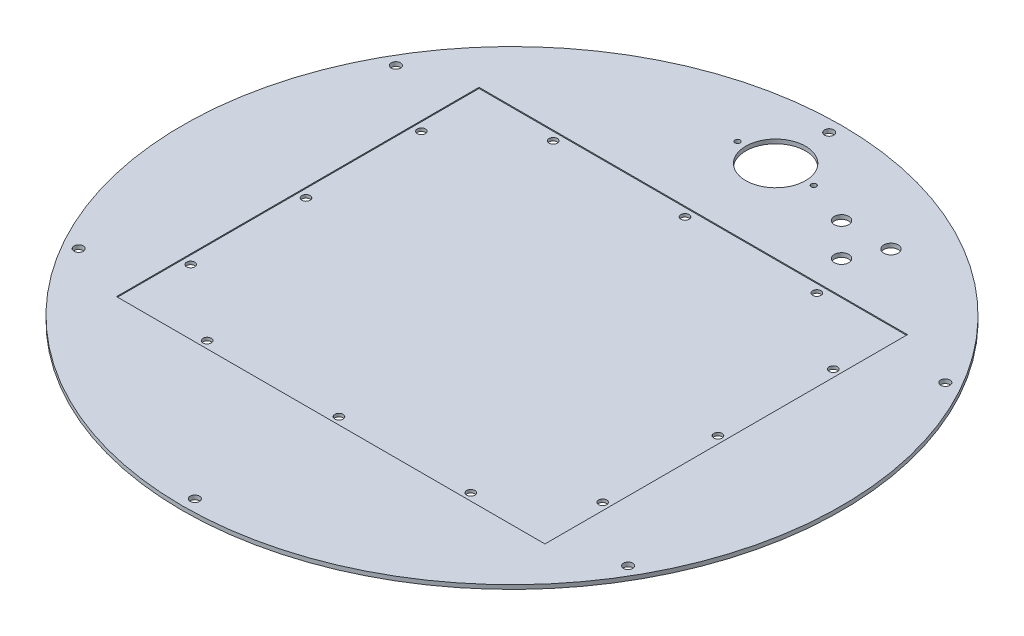
ISO-10303-21;
HEADER;
FILE_DESCRIPTION(('STEP AP214'),'2;1');
FILE_NAME('part.step','',(''),(''),'','','');
FILE_SCHEMA(('AUTOMOTIVE_DESIGN { 1 0 10303 214 1 1 1 1 }'));
ENDSEC;
DATA;
#1=APPLICATION_CONTEXT('core data for automotive mechanical design processes');
#2=APPLICATION_PROTOCOL_DEFINITION('international standard','automotive_design',2000,#1);
#3=PRODUCT_CONTEXT('',#1,'mechanical');
#4=PRODUCT('Part','Part','',(#3));
#5=PRODUCT_RELATED_PRODUCT_CATEGORY('part','',(#4));
#6=PRODUCT_DEFINITION_FORMATION('','',#4);
#7=PRODUCT_DEFINITION_CONTEXT('part definition',#1,'design');
#8=PRODUCT_DEFINITION('design','',#6,#7);
#9=PRODUCT_DEFINITION_SHAPE('','',#8);
#10=(LENGTH_UNIT() NAMED_UNIT(*) SI_UNIT(.MILLI.,.METRE.));
#11=(NAMED_UNIT(*) PLANE_ANGLE_UNIT() SI_UNIT($,.RADIAN.));
#12=(NAMED_UNIT(*) SI_UNIT($,.STERADIAN.) SOLID_ANGLE_UNIT());
#13=UNCERTAINTY_MEASURE_WITH_UNIT(LENGTH_MEASURE(1.E-05),#10,'distance_accuracy_value','');
#14=(GEOMETRIC_REPRESENTATION_CONTEXT(3) GLOBAL_UNCERTAINTY_ASSIGNED_CONTEXT((#13)) GLOBAL_UNIT_ASSIGNED_CONTEXT((#10,
#11,#12)) REPRESENTATION_CONTEXT('',''));
#15=CARTESIAN_POINT('',(0.,0.,0.));
#16=DIRECTION('',(0.,0.,1.));
#17=DIRECTION('',(1.,0.,0.));
#18=AXIS2_PLACEMENT_3D('',#15,#16,#17);
#19=CARTESIAN_POINT('',(0.,-6.35,0.));
#20=DIRECTION('',(0.,1.,0.));
#21=DIRECTION('',(0.,0.,1.));
#22=AXIS2_PLACEMENT_3D('',#19,#20,#21);
#23=CYLINDRICAL_SURFACE('',#22,508.);
#24=CARTESIAN_POINT('',(0.,-6.35,0.));
#25=DIRECTION('',(0.,1.,0.));
#26=DIRECTION('',(0.,0.,1.));
#27=AXIS2_PLACEMENT_3D('',#24,#25,#26);
#28=CIRCLE('',#27,508.);
#29=CARTESIAN_POINT('',(0.,-6.35,508.));
#30=VERTEX_POINT('',#29);
#31=EDGE_CURVE('E11',#30,#30,#28,.T.);
#32=ORIENTED_EDGE('',*,*,#31,.T.);
#33=EDGE_LOOP('',(#32));
#34=FACE_BOUND('',#33,.T.);
#35=CARTESIAN_POINT('',(0.,0.,0.));
#36=DIRECTION('',(0.,1.,0.));
#37=DIRECTION('',(0.,0.,1.));
#38=AXIS2_PLACEMENT_3D('',#35,#36,#37);
#39=CIRCLE('',#38,508.);
#40=CARTESIAN_POINT('',(0.,0.,508.));
#41=VERTEX_POINT('',#40);
#42=EDGE_CURVE('E39',#41,#41,#39,.T.);
#43=ORIENTED_EDGE('',*,*,#42,.F.);
#44=EDGE_LOOP('',(#43));
#45=FACE_BOUND('',#44,.T.);
#46=ADVANCED_FACE('F36',(#34,#45),#23,.T.);
#47=CARTESIAN_POINT('',(0.,-6.35,0.));
#48=DIRECTION('',(0.,1.,0.));
#49=DIRECTION('',(0.,0.,1.));
#50=AXIS2_PLACEMENT_3D('',#47,#48,#49);
#51=PLANE('',#50);
#52=CARTESIAN_POINT('',(177.8,-6.35,-330.2));
#53=DIRECTION('',(0.,1.,0.));
#54=DIRECTION('',(0.,0.,1.));
#55=AXIS2_PLACEMENT_3D('',#52,#53,#54);
#56=CIRCLE('',#55,11.1125);
#57=CARTESIAN_POINT('',(177.8,-6.35,-319.0875));
#58=VERTEX_POINT('',#57);
#59=EDGE_CURVE('E286',#58,#58,#56,.T.);
#60=ORIENTED_EDGE('',*,*,#59,.T.);
#61=EDGE_LOOP('',(#60));
#62=FACE_BOUND('',#61,.T.);
#63=CARTESIAN_POINT('',(203.2,-6.35,-381.));
#64=DIRECTION('',(0.,1.,0.));
#65=DIRECTION('',(0.,0.,1.));
#66=AXIS2_PLACEMENT_3D('',#63,#64,#65);
#67=CIRCLE('',#66,11.1125);
#68=CARTESIAN_POINT('',(203.2,-6.35,-369.8875));
#69=VERTEX_POINT('',#68);
#70=EDGE_CURVE('E294',#69,#69,#67,.T.);
#71=ORIENTED_EDGE('',*,*,#70,.T.);
#72=EDGE_LOOP('',(#71));
#73=FACE_BOUND('',#72,.T.);
#74=CARTESIAN_POINT('',(127.,-6.35,-381.));
#75=DIRECTION('',(0.,1.,0.));
#76=DIRECTION('',(0.,0.,1.));
#77=AXIS2_PLACEMENT_3D('',#74,#75,#76);
#78=CIRCLE('',#77,11.1125);
#79=CARTESIAN_POINT('',(127.,-6.35,-369.8875));
#80=VERTEX_POINT('',#79);
#81=EDGE_CURVE('E300',#80,#80,#78,.T.);
#82=ORIENTED_EDGE('',*,*,#81,.T.);
#83=EDGE_LOOP('',(#82));
#84=FACE_BOUND('',#83,.T.);
#85=CARTESIAN_POINT('',(-58.7374999999999,-6.35,-406.4));
#86=DIRECTION('',(0.,1.,0.));
#87=DIRECTION('',(0.,0.,1.));
#88=AXIS2_PLACEMENT_3D('',#85,#86,#87);
#89=CIRCLE('',#88,3.96875);
#90=CARTESIAN_POINT('',(-58.7374999999999,-6.35,-402.43125));
#91=VERTEX_POINT('',#90);
#92=EDGE_CURVE('E308',#91,#91,#89,.T.);
#93=ORIENTED_EDGE('',*,*,#92,.T.);
#94=EDGE_LOOP('',(#93));
#95=FACE_BOUND('',#94,.T.);
#96=CARTESIAN_POINT('',(58.7375,-6.35,-406.4));
#97=DIRECTION('',(0.,1.,0.));
#98=DIRECTION('',(0.,0.,1.));
#99=AXIS2_PLACEMENT_3D('',#96,#97,#98);
#100=CIRCLE('',#99,3.96874999999999);
#101=CARTESIAN_POINT('',(58.7375,-6.35,-402.43125));
#102=VERTEX_POINT('',#101);
#103=EDGE_CURVE('E314',#102,#102,#100,.T.);
#104=ORIENTED_EDGE('',*,*,#103,.T.);
#105=EDGE_LOOP('',(#104));
#106=FACE_BOUND('',#105,.T.);
#107=CARTESIAN_POINT('',(0.,-6.35,-406.4));
#108=DIRECTION('',(0.,1.,0.));
#109=DIRECTION('',(0.,0.,1.));
#110=AXIS2_PLACEMENT_3D('',#107,#108,#109);
#111=CIRCLE('',#110,46.0375000000001);
#112=CARTESIAN_POINT('',(0.,-6.35,-360.3625));
#113=VERTEX_POINT('',#112);
#114=EDGE_CURVE('E318',#113,#113,#111,.T.);
#115=ORIENTED_EDGE('',*,*,#114,.T.);
#116=EDGE_LOOP('',(#115));
#117=FACE_BOUND('',#116,.T.);
#118=CARTESIAN_POINT('',(-317.5,-6.35,-177.8));
#119=DIRECTION('',(0.,1.,0.));
#120=DIRECTION('',(0.,0.,1.));
#121=AXIS2_PLACEMENT_3D('',#118,#119,#120);
#122=CIRCLE('',#121,6.35000000000002);
#123=CARTESIAN_POINT('',(-317.5,-6.35,-171.45));
#124=VERTEX_POINT('',#123);
#125=EDGE_CURVE('E326',#124,#124,#122,.T.);
#126=ORIENTED_EDGE('',*,*,#125,.T.);
#127=EDGE_LOOP('',(#126));
#128=FACE_BOUND('',#127,.T.);
#129=CARTESIAN_POINT('',(-317.5,-6.35,0.));
#130=DIRECTION('',(0.,1.,0.));
#131=DIRECTION('',(0.,0.,1.));
#132=AXIS2_PLACEMENT_3D('',#129,#130,#131);
#133=CIRCLE('',#132,6.35000000000002);
#134=CARTESIAN_POINT('',(-317.5,-6.35,6.35000000000002));
#135=VERTEX_POINT('',#134);
#136=EDGE_CURVE('E332',#135,#135,#133,.T.);
#137=ORIENTED_EDGE('',*,*,#136,.T.);
#138=EDGE_LOOP('',(#137));
#139=FACE_BOUND('',#138,.T.);
#140=CARTESIAN_POINT('',(-317.5,-6.35,177.8));
#141=DIRECTION('',(0.,1.,0.));
#142=DIRECTION('',(0.,0.,1.));
#143=AXIS2_PLACEMENT_3D('',#140,#141,#142);
#144=CIRCLE('',#143,6.35000000000002);
#145=CARTESIAN_POINT('',(-317.5,-6.35,184.15));
#146=VERTEX_POINT('',#145);
#147=EDGE_CURVE('E338',#146,#146,#144,.T.);
#148=ORIENTED_EDGE('',*,*,#147,.T.);
#149=EDGE_LOOP('',(#148));
#150=FACE_BOUND('',#149,.T.);
#151=CARTESIAN_POINT('',(317.5,-6.35,177.8));
#152=DIRECTION('',(0.,1.,0.));
#153=DIRECTION('',(0.,0.,1.));
#154=AXIS2_PLACEMENT_3D('',#151,#152,#153);
#155=CIRCLE('',#154,6.35000000000002);
#156=CARTESIAN_POINT('',(317.5,-6.35,184.15));
#157=VERTEX_POINT('',#156);
#158=EDGE_CURVE('E344',#157,#157,#155,.T.);
#159=ORIENTED_EDGE('',*,*,#158,.T.);
#160=EDGE_LOOP('',(#159));
#161=FACE_BOUND('',#160,.T.);
#162=CARTESIAN_POINT('',(317.5,-6.35,0.));
#163=DIRECTION('',(0.,1.,0.));
#164=DIRECTION('',(0.,0.,1.));
#165=AXIS2_PLACEMENT_3D('',#162,#163,#164);
#166=CIRCLE('',#165,6.35000000000002);
#167=CARTESIAN_POINT('',(317.5,-6.35,6.34999999999995));
#168=VERTEX_POINT('',#167);
#169=EDGE_CURVE('E350',#168,#168,#166,.T.);
#170=ORIENTED_EDGE('',*,*,#169,.T.);
#171=EDGE_LOOP('',(#170));
#172=FACE_BOUND('',#171,.T.);
#173=CARTESIAN_POINT('',(317.5,-6.35,-177.8));
#174=DIRECTION('',(0.,1.,0.));
#175=DIRECTION('',(0.,0.,1.));
#176=AXIS2_PLACEMENT_3D('',#173,#174,#175);
#177=CIRCLE('',#176,6.35000000000002);
#178=CARTESIAN_POINT('',(317.5,-6.35,-171.45));
#179=VERTEX_POINT('',#178);
#180=EDGE_CURVE('E356',#179,#179,#177,.T.);
#181=ORIENTED_EDGE('',*,*,#180,.T.);
#182=EDGE_LOOP('',(#181));
#183=FACE_BOUND('',#182,.T.);
#184=CARTESIAN_POINT('',(-203.2,-6.35,-266.7));
#185=DIRECTION('',(0.,1.,0.));
#186=DIRECTION('',(0.,0.,1.));
#187=AXIS2_PLACEMENT_3D('',#184,#185,#186);
#188=CIRCLE('',#187,6.34999999999999);
#189=CARTESIAN_POINT('',(-203.2,-6.35,-260.35));
#190=VERTEX_POINT('',#189);
#191=EDGE_CURVE('E362',#190,#190,#188,.T.);
#192=ORIENTED_EDGE('',*,*,#191,.T.);
#193=EDGE_LOOP('',(#192));
#194=FACE_BOUND('',#193,.T.);
#195=CARTESIAN_POINT('',(0.,-6.35,-266.7));
#196=DIRECTION('',(0.,1.,0.));
#197=DIRECTION('',(0.,0.,1.));
#198=AXIS2_PLACEMENT_3D('',#195,#196,#197);
#199=CIRCLE('',#198,6.35);
#200=CARTESIAN_POINT('',(0.,-6.35,-260.35));
#201=VERTEX_POINT('',#200);
#202=EDGE_CURVE('E368',#201,#201,#199,.T.);
#203=ORIENTED_EDGE('',*,*,#202,.T.);
#204=EDGE_LOOP('',(#203));
#205=FACE_BOUND('',#204,.T.);
#206=CARTESIAN_POINT('',(203.2,-6.35,-266.7));
#207=DIRECTION('',(0.,1.,0.));
#208=DIRECTION('',(0.,0.,1.));
#209=AXIS2_PLACEMENT_3D('',#206,#207,#208);
#210=CIRCLE('',#209,6.34999999999999);
#211=CARTESIAN_POINT('',(203.2,-6.35,-260.35));
#212=VERTEX_POINT('',#211);
#213=EDGE_CURVE('E374',#212,#212,#210,.T.);
#214=ORIENTED_EDGE('',*,*,#213,.T.);
#215=EDGE_LOOP('',(#214));
#216=FACE_BOUND('',#215,.T.);
#217=CARTESIAN_POINT('',(203.2,-6.35,266.7));
#218=DIRECTION('',(0.,1.,0.));
#219=DIRECTION('',(0.,0.,1.));
#220=AXIS2_PLACEMENT_3D('',#217,#218,#219);
#221=CIRCLE('',#220,6.34999999999999);
#222=CARTESIAN_POINT('',(203.2,-6.35,273.05));
#223=VERTEX_POINT('',#222);
#224=EDGE_CURVE('E380',#223,#223,#221,.T.);
#225=ORIENTED_EDGE('',*,*,#224,.T.);
#226=EDGE_LOOP('',(#225));
#227=FACE_BOUND('',#226,.T.);
#228=CARTESIAN_POINT('',(0.,-6.35,266.7));
#229=DIRECTION('',(0.,1.,0.));
#230=DIRECTION('',(0.,0.,1.));
#231=AXIS2_PLACEMENT_3D('',#228,#229,#230);
#232=CIRCLE('',#231,6.35);
#233=CARTESIAN_POINT('',(0.,-6.35,273.05));
#234=VERTEX_POINT('',#233);
#235=EDGE_CURVE('E386',#234,#234,#232,.T.);
#236=ORIENTED_EDGE('',*,*,#235,.T.);
#237=EDGE_LOOP('',(#236));
#238=FACE_BOUND('',#237,.T.);
#239=CARTESIAN_POINT('',(-203.2,-6.35,266.7));
#240=DIRECTION('',(0.,1.,0.));
#241=DIRECTION('',(0.,0.,1.));
#242=AXIS2_PLACEMENT_3D('',#239,#240,#241);
#243=CIRCLE('',#242,6.34999999999999);
#244=CARTESIAN_POINT('',(-203.2,-6.35,273.05));
#245=VERTEX_POINT('',#244);
#246=EDGE_CURVE('E107',#245,#245,#243,.T.);
#247=ORIENTED_EDGE('',*,*,#246,.T.);
#248=EDGE_LOOP('',(#247));
#249=FACE_BOUND('',#248,.T.);
#250=CARTESIAN_POINT('',(0.,-6.35,-488.95));
#251=DIRECTION('',(0.,1.,0.));
#252=DIRECTION('',(0.,0.,1.));
#253=AXIS2_PLACEMENT_3D('',#250,#251,#252);
#254=CIRCLE('',#253,7.14375);
#255=CARTESIAN_POINT('',(0.,-6.35,-481.80625));
#256=VERTEX_POINT('',#255);
#257=EDGE_CURVE('E118',#256,#256,#254,.T.);
#258=ORIENTED_EDGE('',*,*,#257,.T.);
#259=EDGE_LOOP('',(#258));
#260=FACE_BOUND('',#259,.T.);
#261=CARTESIAN_POINT('',(423.443121180401,-6.35,-244.475));
#262=DIRECTION('',(0.,1.,0.));
#263=DIRECTION('',(0.,0.,1.));
#264=AXIS2_PLACEMENT_3D('',#261,#262,#263);
#265=CIRCLE('',#264,7.14375);
#266=CARTESIAN_POINT('',(423.443121180401,-6.35,-237.33125));
#267=VERTEX_POINT('',#266);
#268=EDGE_CURVE('E124',#267,#267,#265,.T.);
#269=ORIENTED_EDGE('',*,*,#268,.T.);
#270=EDGE_LOOP('',(#269));
#271=FACE_BOUND('',#270,.T.);
#272=CARTESIAN_POINT('',(423.443121180401,-6.35,244.475));
#273=DIRECTION('',(0.,1.,0.));
#274=DIRECTION('',(0.,0.,1.));
#275=AXIS2_PLACEMENT_3D('',#272,#273,#274);
#276=CIRCLE('',#275,7.14375);
#277=CARTESIAN_POINT('',(423.443121180401,-6.35,251.61875));
#278=VERTEX_POINT('',#277);
#279=EDGE_CURVE('E130',#278,#278,#276,.T.);
#280=ORIENTED_EDGE('',*,*,#279,.T.);
#281=EDGE_LOOP('',(#280));
#282=FACE_BOUND('',#281,.T.);
#283=CARTESIAN_POINT('',(0.,-6.35,488.95));
#284=DIRECTION('',(0.,1.,0.));
#285=DIRECTION('',(0.,0.,1.));
#286=AXIS2_PLACEMENT_3D('',#283,#284,#285);
#287=CIRCLE('',#286,7.14375);
#288=CARTESIAN_POINT('',(0.,-6.35,496.09375));
#289=VERTEX_POINT('',#288);
#290=EDGE_CURVE('E136',#289,#289,#287,.T.);
#291=ORIENTED_EDGE('',*,*,#290,.T.);
#292=EDGE_LOOP('',(#291));
#293=FACE_BOUND('',#292,.T.);
#294=CARTESIAN_POINT('',(-423.443121180401,-6.35,244.475));
#295=DIRECTION('',(0.,1.,0.));
#296=DIRECTION('',(0.,0.,1.));
#297=AXIS2_PLACEMENT_3D('',#294,#295,#296);
#298=CIRCLE('',#297,7.14375);
#299=CARTESIAN_POINT('',(-423.443121180401,-6.35,251.61875));
#300=VERTEX_POINT('',#299);
#301=EDGE_CURVE('E142',#300,#300,#298,.T.);
#302=ORIENTED_EDGE('',*,*,#301,.T.);
#303=EDGE_LOOP('',(#302));
#304=FACE_BOUND('',#303,.T.);
#305=CARTESIAN_POINT('',(-423.443121180401,-6.35,-244.475));
#306=DIRECTION('',(0.,1.,0.));
#307=DIRECTION('',(0.,0.,1.));
#308=AXIS2_PLACEMENT_3D('',#305,#306,#307);
#309=CIRCLE('',#308,7.14375);
#310=CARTESIAN_POINT('',(-423.443121180401,-6.35,-237.33125));
#311=VERTEX_POINT('',#310);
#312=EDGE_CURVE('E148',#311,#311,#309,.T.);
#313=ORIENTED_EDGE('',*,*,#312,.T.);
#314=EDGE_LOOP('',(#313));
#315=FACE_BOUND('',#314,.T.);
#316=ORIENTED_EDGE('',*,*,#31,.F.);
#317=EDGE_LOOP('',(#316));
#318=FACE_BOUND('',#317,.T.);
#319=ADVANCED_FACE('F158',(#62,#73,#84,#95,#106,#117,#128,#139,#150,#161,#172,#183,#194,#205,
#216,#227,#238,#249,#260,#271,#282,#293,#304,#315,#318),#51,.F.);
#320=CARTESIAN_POINT('',(0.,0.,0.));
#321=DIRECTION('',(0.,1.,0.));
#322=DIRECTION('',(0.,0.,1.));
#323=AXIS2_PLACEMENT_3D('',#320,#321,#322);
#324=PLANE('',#323);
#325=CARTESIAN_POINT('',(177.8,0.,-330.2));
#326=DIRECTION('',(0.,1.,0.));
#327=DIRECTION('',(0.,0.,1.));
#328=AXIS2_PLACEMENT_3D('',#325,#326,#327);
#329=CIRCLE('',#328,11.1125);
#330=CARTESIAN_POINT('',(177.8,0.,-319.0875));
#331=VERTEX_POINT('',#330);
#332=EDGE_CURVE('E289',#331,#331,#329,.T.);
#333=ORIENTED_EDGE('',*,*,#332,.F.);
#334=EDGE_LOOP('',(#333));
#335=FACE_BOUND('',#334,.T.);
#336=CARTESIAN_POINT('',(203.2,0.,-381.));
#337=DIRECTION('',(0.,1.,0.));
#338=DIRECTION('',(0.,0.,1.));
#339=AXIS2_PLACEMENT_3D('',#336,#337,#338);
#340=CIRCLE('',#339,11.1125);
#341=CARTESIAN_POINT('',(203.2,0.,-369.8875));
#342=VERTEX_POINT('',#341);
#343=EDGE_CURVE('E291',#342,#342,#340,.T.);
#344=ORIENTED_EDGE('',*,*,#343,.F.);
#345=EDGE_LOOP('',(#344));
#346=FACE_BOUND('',#345,.T.);
#347=CARTESIAN_POINT('',(127.,0.,-381.));
#348=DIRECTION('',(0.,1.,0.));
#349=DIRECTION('',(0.,0.,1.));
#350=AXIS2_PLACEMENT_3D('',#347,#348,#349);
#351=CIRCLE('',#350,11.1125);
#352=CARTESIAN_POINT('',(127.,0.,-369.8875));
#353=VERTEX_POINT('',#352);
#354=EDGE_CURVE('E297',#353,#353,#351,.T.);
#355=ORIENTED_EDGE('',*,*,#354,.F.);
#356=EDGE_LOOP('',(#355));
#357=FACE_BOUND('',#356,.T.);
#358=CARTESIAN_POINT('',(-58.7374999999999,0.,-406.4));
#359=DIRECTION('',(0.,1.,0.));
#360=DIRECTION('',(0.,0.,1.));
#361=AXIS2_PLACEMENT_3D('',#358,#359,#360);
#362=CIRCLE('',#361,3.96875);
#363=CARTESIAN_POINT('',(-58.7374999999999,0.,-402.43125));
#364=VERTEX_POINT('',#363);
#365=EDGE_CURVE('E303',#364,#364,#362,.T.);
#366=ORIENTED_EDGE('',*,*,#365,.F.);
#367=EDGE_LOOP('',(#366));
#368=FACE_BOUND('',#367,.T.);
#369=CARTESIAN_POINT('',(58.7375,0.,-406.4));
#370=DIRECTION('',(0.,1.,0.));
#371=DIRECTION('',(0.,0.,1.));
#372=AXIS2_PLACEMENT_3D('',#369,#370,#371);
#373=CIRCLE('',#372,3.96874999999999);
#374=CARTESIAN_POINT('',(58.7375,0.,-402.43125));
#375=VERTEX_POINT('',#374);
#376=EDGE_CURVE('E311',#375,#375,#373,.T.);
#377=ORIENTED_EDGE('',*,*,#376,.F.);
#378=EDGE_LOOP('',(#377));
#379=FACE_BOUND('',#378,.T.);
#380=CARTESIAN_POINT('',(0.,0.,-406.4));
#381=DIRECTION('',(0.,1.,0.));
#382=DIRECTION('',(0.,0.,1.));
#383=AXIS2_PLACEMENT_3D('',#380,#381,#382);
#384=CIRCLE('',#383,46.0375000000001);
#385=CARTESIAN_POINT('',(0.,0.,-360.3625));
#386=VERTEX_POINT('',#385);
#387=EDGE_CURVE('E317',#386,#386,#384,.T.);
#388=ORIENTED_EDGE('',*,*,#387,.F.);
#389=EDGE_LOOP('',(#388));
#390=FACE_BOUND('',#389,.T.);
#391=DIRECTION('',(0.,0.,1.));
#392=VECTOR('',#391,1.);
#393=CARTESIAN_POINT('',(-330.2,0.,-279.4));
#394=LINE('',#393,#392);
#395=CARTESIAN_POINT('',(-330.2,0.,-279.4));
#396=VERTEX_POINT('',#395);
#397=CARTESIAN_POINT('',(-330.2,0.,279.4));
#398=VERTEX_POINT('',#397);
#399=EDGE_CURVE('E50',#396,#398,#394,.T.);
#400=ORIENTED_EDGE('',*,*,#399,.F.);
#401=DIRECTION('',(-1.,0.,0.));
#402=VECTOR('',#401,1.);
#403=CARTESIAN_POINT('',(-330.2,0.,-279.4));
#404=LINE('',#403,#402);
#405=CARTESIAN_POINT('',(330.2,0.,-279.4));
#406=VERTEX_POINT('',#405);
#407=EDGE_CURVE('E101',#406,#396,#404,.T.);
#408=ORIENTED_EDGE('',*,*,#407,.F.);
#409=DIRECTION('',(0.,0.,-1.));
#410=VECTOR('',#409,1.);
#411=CARTESIAN_POINT('',(330.2,0.,-279.4));
#412=LINE('',#411,#410);
#413=CARTESIAN_POINT('',(330.2,0.,279.4));
#414=VERTEX_POINT('',#413);
#415=EDGE_CURVE('E109',#414,#406,#412,.T.);
#416=ORIENTED_EDGE('',*,*,#415,.F.);
#417=DIRECTION('',(1.,0.,0.));
#418=VECTOR('',#417,1.);
#419=CARTESIAN_POINT('',(-330.2,0.,279.4));
#420=LINE('',#419,#418);
#421=EDGE_CURVE('E85',#398,#414,#420,.T.);
#422=ORIENTED_EDGE('',*,*,#421,.F.);
#423=EDGE_LOOP('',(#400,#408,#416,#422));
#424=FACE_BOUND('',#423,.T.);
#425=CARTESIAN_POINT('',(0.,0.,-488.95));
#426=DIRECTION('',(0.,1.,0.));
#427=DIRECTION('',(0.,0.,1.));
#428=AXIS2_PLACEMENT_3D('',#425,#426,#427);
#429=CIRCLE('',#428,7.14374999999999);
#430=CARTESIAN_POINT('',(0.,0.,-481.80625));
#431=VERTEX_POINT('',#430);
#432=EDGE_CURVE('E113',#431,#431,#429,.T.);
#433=ORIENTED_EDGE('',*,*,#432,.F.);
#434=EDGE_LOOP('',(#433));
#435=FACE_BOUND('',#434,.T.);
#436=CARTESIAN_POINT('',(423.443121180401,0.,-244.475));
#437=DIRECTION('',(0.,1.,0.));
#438=DIRECTION('',(0.,0.,1.));
#439=AXIS2_PLACEMENT_3D('',#436,#437,#438);
#440=CIRCLE('',#439,7.14375);
#441=CARTESIAN_POINT('',(423.443121180401,0.,-237.33125));
#442=VERTEX_POINT('',#441);
#443=EDGE_CURVE('E121',#442,#442,#440,.T.);
#444=ORIENTED_EDGE('',*,*,#443,.F.);
#445=EDGE_LOOP('',(#444));
#446=FACE_BOUND('',#445,.T.);
#447=CARTESIAN_POINT('',(423.443121180401,0.,244.475));
#448=DIRECTION('',(0.,1.,0.));
#449=DIRECTION('',(0.,0.,1.));
#450=AXIS2_PLACEMENT_3D('',#447,#448,#449);
#451=CIRCLE('',#450,7.14375);
#452=CARTESIAN_POINT('',(423.443121180401,0.,251.61875));
#453=VERTEX_POINT('',#452);
#454=EDGE_CURVE('E127',#453,#453,#451,.T.);
#455=ORIENTED_EDGE('',*,*,#454,.F.);
#456=EDGE_LOOP('',(#455));
#457=FACE_BOUND('',#456,.T.);
#458=CARTESIAN_POINT('',(0.,0.,488.95));
#459=DIRECTION('',(0.,1.,0.));
#460=DIRECTION('',(0.,0.,1.));
#461=AXIS2_PLACEMENT_3D('',#458,#459,#460);
#462=CIRCLE('',#461,7.14374999999999);
#463=CARTESIAN_POINT('',(0.,0.,496.09375));
#464=VERTEX_POINT('',#463);
#465=EDGE_CURVE('E133',#464,#464,#462,.T.);
#466=ORIENTED_EDGE('',*,*,#465,.F.);
#467=EDGE_LOOP('',(#466));
#468=FACE_BOUND('',#467,.T.);
#469=CARTESIAN_POINT('',(-423.443121180401,0.,244.475));
#470=DIRECTION('',(0.,1.,0.));
#471=DIRECTION('',(0.,0.,1.));
#472=AXIS2_PLACEMENT_3D('',#469,#470,#471);
#473=CIRCLE('',#472,7.14375);
#474=CARTESIAN_POINT('',(-423.443121180401,0.,251.61875));
#475=VERTEX_POINT('',#474);
#476=EDGE_CURVE('E139',#475,#475,#473,.T.);
#477=ORIENTED_EDGE('',*,*,#476,.F.);
#478=EDGE_LOOP('',(#477));
#479=FACE_BOUND('',#478,.T.);
#480=CARTESIAN_POINT('',(-423.443121180401,0.,-244.475));
#481=DIRECTION('',(0.,1.,0.));
#482=DIRECTION('',(0.,0.,1.));
#483=AXIS2_PLACEMENT_3D('',#480,#481,#482);
#484=CIRCLE('',#483,7.14375);
#485=CARTESIAN_POINT('',(-423.443121180401,0.,-237.33125));
#486=VERTEX_POINT('',#485);
#487=EDGE_CURVE('E145',#486,#486,#484,.T.);
#488=ORIENTED_EDGE('',*,*,#487,.F.);
#489=EDGE_LOOP('',(#488));
#490=FACE_BOUND('',#489,.T.);
#491=ORIENTED_EDGE('',*,*,#42,.T.);
#492=EDGE_LOOP('',(#491));
#493=FACE_BOUND('',#492,.T.);
#494=ADVANCED_FACE('F155',(#335,#346,#357,#368,#379,#390,#424,#435,#446,#457,#468,#479,#490,
#493),#324,.T.);
#495=CARTESIAN_POINT('',(-423.443121180401,0.,-244.475));
#496=DIRECTION('',(0.,1.,0.));
#497=DIRECTION('',(0.,0.,1.));
#498=AXIS2_PLACEMENT_3D('',#495,#496,#497);
#499=CYLINDRICAL_SURFACE('',#498,7.14375);
#500=ORIENTED_EDGE('',*,*,#312,.F.);
#501=EDGE_LOOP('',(#500));
#502=FACE_BOUND('',#501,.T.);
#503=ORIENTED_EDGE('',*,*,#487,.T.);
#504=EDGE_LOOP('',(#503));
#505=FACE_BOUND('',#504,.T.);
#506=ADVANCED_FACE('F170',(#502,#505),#499,.F.);
#507=CARTESIAN_POINT('',(-423.443121180401,0.,244.475));
#508=DIRECTION('',(0.,1.,0.));
#509=DIRECTION('',(0.,0.,1.));
#510=AXIS2_PLACEMENT_3D('',#507,#508,#509);
#511=CYLINDRICAL_SURFACE('',#510,7.14375);
#512=ORIENTED_EDGE('',*,*,#301,.F.);
#513=EDGE_LOOP('',(#512));
#514=FACE_BOUND('',#513,.T.);
#515=ORIENTED_EDGE('',*,*,#476,.T.);
#516=EDGE_LOOP('',(#515));
#517=FACE_BOUND('',#516,.T.);
#518=ADVANCED_FACE('F177',(#514,#517),#511,.F.);
#519=CARTESIAN_POINT('',(0.,0.,488.95));
#520=DIRECTION('',(0.,1.,0.));
#521=DIRECTION('',(0.,0.,1.));
#522=AXIS2_PLACEMENT_3D('',#519,#520,#521);
#523=CYLINDRICAL_SURFACE('',#522,7.14374999999999);
#524=ORIENTED_EDGE('',*,*,#290,.F.);
#525=EDGE_LOOP('',(#524));
#526=FACE_BOUND('',#525,.T.);
#527=ORIENTED_EDGE('',*,*,#465,.T.);
#528=EDGE_LOOP('',(#527));
#529=FACE_BOUND('',#528,.T.);
#530=ADVANCED_FACE('F181',(#526,#529),#523,.F.);
#531=CARTESIAN_POINT('',(423.443121180401,0.,244.475));
#532=DIRECTION('',(0.,1.,0.));
#533=DIRECTION('',(0.,0.,1.));
#534=AXIS2_PLACEMENT_3D('',#531,#532,#533);
#535=CYLINDRICAL_SURFACE('',#534,7.14375);
#536=ORIENTED_EDGE('',*,*,#279,.F.);
#537=EDGE_LOOP('',(#536));
#538=FACE_BOUND('',#537,.T.);
#539=ORIENTED_EDGE('',*,*,#454,.T.);
#540=EDGE_LOOP('',(#539));
#541=FACE_BOUND('',#540,.T.);
#542=ADVANCED_FACE('F185',(#538,#541),#535,.F.);
#543=CARTESIAN_POINT('',(423.443121180401,0.,-244.475));
#544=DIRECTION('',(0.,1.,0.));
#545=DIRECTION('',(0.,0.,1.));
#546=AXIS2_PLACEMENT_3D('',#543,#544,#545);
#547=CYLINDRICAL_SURFACE('',#546,7.14375);
#548=ORIENTED_EDGE('',*,*,#268,.F.);
#549=EDGE_LOOP('',(#548));
#550=FACE_BOUND('',#549,.T.);
#551=ORIENTED_EDGE('',*,*,#443,.T.);
#552=EDGE_LOOP('',(#551));
#553=FACE_BOUND('',#552,.T.);
#554=ADVANCED_FACE('F189',(#550,#553),#547,.F.);
#555=CARTESIAN_POINT('',(0.,0.,-488.95));
#556=DIRECTION('',(0.,1.,0.));
#557=DIRECTION('',(0.,0.,1.));
#558=AXIS2_PLACEMENT_3D('',#555,#556,#557);
#559=CYLINDRICAL_SURFACE('',#558,7.14374999999999);
#560=ORIENTED_EDGE('',*,*,#257,.F.);
#561=EDGE_LOOP('',(#560));
#562=FACE_BOUND('',#561,.T.);
#563=ORIENTED_EDGE('',*,*,#432,.T.);
#564=EDGE_LOOP('',(#563));
#565=FACE_BOUND('',#564,.T.);
#566=ADVANCED_FACE('F193',(#562,#565),#559,.F.);
#567=CARTESIAN_POINT('',(-330.2,-1.5875,-279.4));
#568=DIRECTION('',(-1.,0.,0.));
#569=DIRECTION('',(0.,0.,1.));
#570=AXIS2_PLACEMENT_3D('',#567,#568,#569);
#571=PLANE('',#570);
#572=ORIENTED_EDGE('',*,*,#399,.T.);
#573=DIRECTION('',(0.,1.,0.));
#574=VECTOR('',#573,1.);
#575=CARTESIAN_POINT('',(-330.2,-1.5875,279.4));
#576=LINE('',#575,#574);
#577=CARTESIAN_POINT('',(-330.2,-1.5875,279.4));
#578=VERTEX_POINT('',#577);
#579=EDGE_CURVE('E73',#578,#398,#576,.T.);
#580=ORIENTED_EDGE('',*,*,#579,.F.);
#581=DIRECTION('',(0.,0.,1.));
#582=VECTOR('',#581,1.);
#583=CARTESIAN_POINT('',(-330.2,-1.5875,-279.4));
#584=LINE('',#583,#582);
#585=CARTESIAN_POINT('',(-330.2,-1.5875,-279.4));
#586=VERTEX_POINT('',#585);
#587=EDGE_CURVE('E99',#586,#578,#584,.T.);
#588=ORIENTED_EDGE('',*,*,#587,.F.);
#589=DIRECTION('',(0.,1.,0.));
#590=VECTOR('',#589,1.);
#591=CARTESIAN_POINT('',(-330.2,-1.5875,-279.4));
#592=LINE('',#591,#590);
#593=EDGE_CURVE('E58',#586,#396,#592,.T.);
#594=ORIENTED_EDGE('',*,*,#593,.T.);
#595=EDGE_LOOP('',(#572,#580,#588,#594));
#596=FACE_BOUND('',#595,.T.);
#597=ADVANCED_FACE('F197',(#596),#571,.F.);
#598=CARTESIAN_POINT('',(-330.2,-1.5875,-279.4));
#599=DIRECTION('',(0.,0.,-1.));
#600=DIRECTION('',(-1.,0.,0.));
#601=AXIS2_PLACEMENT_3D('',#598,#599,#600);
#602=PLANE('',#601);
#603=ORIENTED_EDGE('',*,*,#407,.T.);
#604=ORIENTED_EDGE('',*,*,#593,.F.);
#605=DIRECTION('',(-1.,0.,0.));
#606=VECTOR('',#605,1.);
#607=CARTESIAN_POINT('',(-330.2,-1.5875,-279.4));
#608=LINE('',#607,#606);
#609=CARTESIAN_POINT('',(330.2,-1.5875,-279.4));
#610=VERTEX_POINT('',#609);
#611=EDGE_CURVE('E96',#610,#586,#608,.T.);
#612=ORIENTED_EDGE('',*,*,#611,.F.);
#613=DIRECTION('',(0.,1.,0.));
#614=VECTOR('',#613,1.);
#615=CARTESIAN_POINT('',(330.2,-1.5875,-279.4));
#616=LINE('',#615,#614);
#617=EDGE_CURVE('E89',#610,#406,#616,.T.);
#618=ORIENTED_EDGE('',*,*,#617,.T.);
#619=EDGE_LOOP('',(#603,#604,#612,#618));
#620=FACE_BOUND('',#619,.T.);
#621=ADVANCED_FACE('F201',(#620),#602,.F.);
#622=CARTESIAN_POINT('',(330.2,-1.5875,-279.4));
#623=DIRECTION('',(1.,0.,0.));
#624=DIRECTION('',(0.,0.,-1.));
#625=AXIS2_PLACEMENT_3D('',#622,#623,#624);
#626=PLANE('',#625);
#627=ORIENTED_EDGE('',*,*,#415,.T.);
#628=ORIENTED_EDGE('',*,*,#617,.F.);
#629=DIRECTION('',(0.,0.,-1.));
#630=VECTOR('',#629,1.);
#631=CARTESIAN_POINT('',(330.2,-1.5875,-279.4));
#632=LINE('',#631,#630);
#633=CARTESIAN_POINT('',(330.2,-1.5875,279.4));
#634=VERTEX_POINT('',#633);
#635=EDGE_CURVE('E92',#634,#610,#632,.T.);
#636=ORIENTED_EDGE('',*,*,#635,.F.);
#637=DIRECTION('',(0.,1.,0.));
#638=VECTOR('',#637,1.);
#639=CARTESIAN_POINT('',(330.2,-1.5875,279.4));
#640=LINE('',#639,#638);
#641=EDGE_CURVE('E78',#634,#414,#640,.T.);
#642=ORIENTED_EDGE('',*,*,#641,.T.);
#643=EDGE_LOOP('',(#627,#628,#636,#642));
#644=FACE_BOUND('',#643,.T.);
#645=ADVANCED_FACE('F93',(#644),#626,.F.);
#646=CARTESIAN_POINT('',(-330.2,-1.5875,279.4));
#647=DIRECTION('',(0.,0.,1.));
#648=DIRECTION('',(1.,0.,0.));
#649=AXIS2_PLACEMENT_3D('',#646,#647,#648);
#650=PLANE('',#649);
#651=ORIENTED_EDGE('',*,*,#421,.T.);
#652=ORIENTED_EDGE('',*,*,#641,.F.);
#653=DIRECTION('',(1.,0.,0.));
#654=VECTOR('',#653,1.);
#655=CARTESIAN_POINT('',(-330.2,-1.5875,279.4));
#656=LINE('',#655,#654);
#657=EDGE_CURVE('E82',#578,#634,#656,.T.);
#658=ORIENTED_EDGE('',*,*,#657,.F.);
#659=ORIENTED_EDGE('',*,*,#579,.T.);
#660=EDGE_LOOP('',(#651,#652,#658,#659));
#661=FACE_BOUND('',#660,.T.);
#662=ADVANCED_FACE('F80',(#661),#650,.F.);
#663=CARTESIAN_POINT('',(-330.2,-1.5875,279.4));
#664=DIRECTION('',(0.,1.,0.));
#665=DIRECTION('',(0.,0.,1.));
#666=AXIS2_PLACEMENT_3D('',#663,#664,#665);
#667=PLANE('',#666);
#668=CARTESIAN_POINT('',(-317.5,-1.5875,-177.8));
#669=DIRECTION('',(0.,1.,0.));
#670=DIRECTION('',(0.,0.,1.));
#671=AXIS2_PLACEMENT_3D('',#668,#669,#670);
#672=CIRCLE('',#671,6.35000000000002);
#673=CARTESIAN_POINT('',(-317.5,-1.5875,-171.45));
#674=VERTEX_POINT('',#673);
#675=EDGE_CURVE('E321',#674,#674,#672,.T.);
#676=ORIENTED_EDGE('',*,*,#675,.F.);
#677=EDGE_LOOP('',(#676));
#678=FACE_BOUND('',#677,.T.);
#679=CARTESIAN_POINT('',(-317.5,-1.5875,0.));
#680=DIRECTION('',(0.,1.,0.));
#681=DIRECTION('',(0.,0.,1.));
#682=AXIS2_PLACEMENT_3D('',#679,#680,#681);
#683=CIRCLE('',#682,6.35000000000002);
#684=CARTESIAN_POINT('',(-317.5,-1.5875,6.35000000000002));
#685=VERTEX_POINT('',#684);
#686=EDGE_CURVE('E329',#685,#685,#683,.T.);
#687=ORIENTED_EDGE('',*,*,#686,.F.);
#688=EDGE_LOOP('',(#687));
#689=FACE_BOUND('',#688,.T.);
#690=CARTESIAN_POINT('',(-317.5,-1.5875,177.8));
#691=DIRECTION('',(0.,1.,0.));
#692=DIRECTION('',(0.,0.,1.));
#693=AXIS2_PLACEMENT_3D('',#690,#691,#692);
#694=CIRCLE('',#693,6.35000000000002);
#695=CARTESIAN_POINT('',(-317.5,-1.5875,184.15));
#696=VERTEX_POINT('',#695);
#697=EDGE_CURVE('E335',#696,#696,#694,.T.);
#698=ORIENTED_EDGE('',*,*,#697,.F.);
#699=EDGE_LOOP('',(#698));
#700=FACE_BOUND('',#699,.T.);
#701=CARTESIAN_POINT('',(317.5,-1.5875,177.8));
#702=DIRECTION('',(0.,1.,0.));
#703=DIRECTION('',(0.,0.,1.));
#704=AXIS2_PLACEMENT_3D('',#701,#702,#703);
#705=CIRCLE('',#704,6.35000000000002);
#706=CARTESIAN_POINT('',(317.5,-1.5875,184.15));
#707=VERTEX_POINT('',#706);
#708=EDGE_CURVE('E341',#707,#707,#705,.T.);
#709=ORIENTED_EDGE('',*,*,#708,.F.);
#710=EDGE_LOOP('',(#709));
#711=FACE_BOUND('',#710,.T.);
#712=CARTESIAN_POINT('',(317.5,-1.5875,0.));
#713=DIRECTION('',(0.,1.,0.));
#714=DIRECTION('',(0.,0.,1.));
#715=AXIS2_PLACEMENT_3D('',#712,#713,#714);
#716=CIRCLE('',#715,6.35000000000002);
#717=CARTESIAN_POINT('',(317.5,-1.5875,6.34999999999995));
#718=VERTEX_POINT('',#717);
#719=EDGE_CURVE('E347',#718,#718,#716,.T.);
#720=ORIENTED_EDGE('',*,*,#719,.F.);
#721=EDGE_LOOP('',(#720));
#722=FACE_BOUND('',#721,.T.);
#723=CARTESIAN_POINT('',(317.5,-1.5875,-177.8));
#724=DIRECTION('',(0.,1.,0.));
#725=DIRECTION('',(0.,0.,1.));
#726=AXIS2_PLACEMENT_3D('',#723,#724,#725);
#727=CIRCLE('',#726,6.35000000000002);
#728=CARTESIAN_POINT('',(317.5,-1.5875,-171.45));
#729=VERTEX_POINT('',#728);
#730=EDGE_CURVE('E353',#729,#729,#727,.T.);
#731=ORIENTED_EDGE('',*,*,#730,.F.);
#732=EDGE_LOOP('',(#731));
#733=FACE_BOUND('',#732,.T.);
#734=CARTESIAN_POINT('',(-203.2,-1.5875,-266.7));
#735=DIRECTION('',(0.,1.,0.));
#736=DIRECTION('',(0.,0.,1.));
#737=AXIS2_PLACEMENT_3D('',#734,#735,#736);
#738=CIRCLE('',#737,6.34999999999999);
#739=CARTESIAN_POINT('',(-203.2,-1.5875,-260.35));
#740=VERTEX_POINT('',#739);
#741=EDGE_CURVE('E359',#740,#740,#738,.T.);
#742=ORIENTED_EDGE('',*,*,#741,.F.);
#743=EDGE_LOOP('',(#742));
#744=FACE_BOUND('',#743,.T.);
#745=CARTESIAN_POINT('',(0.,-1.5875,-266.7));
#746=DIRECTION('',(0.,1.,0.));
#747=DIRECTION('',(0.,0.,1.));
#748=AXIS2_PLACEMENT_3D('',#745,#746,#747);
#749=CIRCLE('',#748,6.35);
#750=CARTESIAN_POINT('',(0.,-1.5875,-260.35));
#751=VERTEX_POINT('',#750);
#752=EDGE_CURVE('E365',#751,#751,#749,.T.);
#753=ORIENTED_EDGE('',*,*,#752,.F.);
#754=EDGE_LOOP('',(#753));
#755=FACE_BOUND('',#754,.T.);
#756=CARTESIAN_POINT('',(203.2,-1.5875,-266.7));
#757=DIRECTION('',(0.,1.,0.));
#758=DIRECTION('',(0.,0.,1.));
#759=AXIS2_PLACEMENT_3D('',#756,#757,#758);
#760=CIRCLE('',#759,6.34999999999999);
#761=CARTESIAN_POINT('',(203.2,-1.5875,-260.35));
#762=VERTEX_POINT('',#761);
#763=EDGE_CURVE('E371',#762,#762,#760,.T.);
#764=ORIENTED_EDGE('',*,*,#763,.F.);
#765=EDGE_LOOP('',(#764));
#766=FACE_BOUND('',#765,.T.);
#767=CARTESIAN_POINT('',(203.2,-1.5875,266.7));
#768=DIRECTION('',(0.,1.,0.));
#769=DIRECTION('',(0.,0.,1.));
#770=AXIS2_PLACEMENT_3D('',#767,#768,#769);
#771=CIRCLE('',#770,6.34999999999999);
#772=CARTESIAN_POINT('',(203.2,-1.5875,273.05));
#773=VERTEX_POINT('',#772);
#774=EDGE_CURVE('E377',#773,#773,#771,.T.);
#775=ORIENTED_EDGE('',*,*,#774,.F.);
#776=EDGE_LOOP('',(#775));
#777=FACE_BOUND('',#776,.T.);
#778=CARTESIAN_POINT('',(0.,-1.5875,266.7));
#779=DIRECTION('',(0.,1.,0.));
#780=DIRECTION('',(0.,0.,1.));
#781=AXIS2_PLACEMENT_3D('',#778,#779,#780);
#782=CIRCLE('',#781,6.35);
#783=CARTESIAN_POINT('',(0.,-1.5875,273.05));
#784=VERTEX_POINT('',#783);
#785=EDGE_CURVE('E383',#784,#784,#782,.T.);
#786=ORIENTED_EDGE('',*,*,#785,.F.);
#787=EDGE_LOOP('',(#786));
#788=FACE_BOUND('',#787,.T.);
#789=CARTESIAN_POINT('',(-203.2,-1.5875,266.7));
#790=DIRECTION('',(0.,1.,0.));
#791=DIRECTION('',(0.,0.,1.));
#792=AXIS2_PLACEMENT_3D('',#789,#790,#791);
#793=CIRCLE('',#792,6.34999999999999);
#794=CARTESIAN_POINT('',(-203.2,-1.5875,273.05));
#795=VERTEX_POINT('',#794);
#796=EDGE_CURVE('E389',#795,#795,#793,.T.);
#797=ORIENTED_EDGE('',*,*,#796,.F.);
#798=EDGE_LOOP('',(#797));
#799=FACE_BOUND('',#798,.T.);
#800=ORIENTED_EDGE('',*,*,#587,.T.);
#801=ORIENTED_EDGE('',*,*,#657,.T.);
#802=ORIENTED_EDGE('',*,*,#635,.T.);
#803=ORIENTED_EDGE('',*,*,#611,.T.);
#804=EDGE_LOOP('',(#800,#801,#802,#803));
#805=FACE_BOUND('',#804,.T.);
#806=ADVANCED_FACE('F98',(#678,#689,#700,#711,#722,#733,#744,#755,#766,#777,#788,#799,#805),
#667,.T.);
#807=CARTESIAN_POINT('',(-203.2,-1.5875,266.7));
#808=DIRECTION('',(0.,1.,0.));
#809=DIRECTION('',(0.,0.,1.));
#810=AXIS2_PLACEMENT_3D('',#807,#808,#809);
#811=CYLINDRICAL_SURFACE('',#810,6.34999999999999);
#812=ORIENTED_EDGE('',*,*,#246,.F.);
#813=EDGE_LOOP('',(#812));
#814=FACE_BOUND('',#813,.T.);
#815=ORIENTED_EDGE('',*,*,#796,.T.);
#816=EDGE_LOOP('',(#815));
#817=FACE_BOUND('',#816,.T.);
#818=ADVANCED_FACE('F210',(#814,#817),#811,.F.);
#819=CARTESIAN_POINT('',(0.,-1.5875,266.7));
#820=DIRECTION('',(0.,1.,0.));
#821=DIRECTION('',(0.,0.,1.));
#822=AXIS2_PLACEMENT_3D('',#819,#820,#821);
#823=CYLINDRICAL_SURFACE('',#822,6.35);
#824=ORIENTED_EDGE('',*,*,#235,.F.);
#825=EDGE_LOOP('',(#824));
#826=FACE_BOUND('',#825,.T.);
#827=ORIENTED_EDGE('',*,*,#785,.T.);
#828=EDGE_LOOP('',(#827));
#829=FACE_BOUND('',#828,.T.);
#830=ADVANCED_FACE('F214',(#826,#829),#823,.F.);
#831=CARTESIAN_POINT('',(203.2,-1.5875,266.7));
#832=DIRECTION('',(0.,1.,0.));
#833=DIRECTION('',(0.,0.,1.));
#834=AXIS2_PLACEMENT_3D('',#831,#832,#833);
#835=CYLINDRICAL_SURFACE('',#834,6.34999999999999);
#836=ORIENTED_EDGE('',*,*,#224,.F.);
#837=EDGE_LOOP('',(#836));
#838=FACE_BOUND('',#837,.T.);
#839=ORIENTED_EDGE('',*,*,#774,.T.);
#840=EDGE_LOOP('',(#839));
#841=FACE_BOUND('',#840,.T.);
#842=ADVANCED_FACE('F218',(#838,#841),#835,.F.);
#843=CARTESIAN_POINT('',(203.2,-1.5875,-266.7));
#844=DIRECTION('',(0.,1.,0.));
#845=DIRECTION('',(0.,0.,1.));
#846=AXIS2_PLACEMENT_3D('',#843,#844,#845);
#847=CYLINDRICAL_SURFACE('',#846,6.34999999999999);
#848=ORIENTED_EDGE('',*,*,#213,.F.);
#849=EDGE_LOOP('',(#848));
#850=FACE_BOUND('',#849,.T.);
#851=ORIENTED_EDGE('',*,*,#763,.T.);
#852=EDGE_LOOP('',(#851));
#853=FACE_BOUND('',#852,.T.);
#854=ADVANCED_FACE('F222',(#850,#853),#847,.F.);
#855=CARTESIAN_POINT('',(0.,-1.5875,-266.7));
#856=DIRECTION('',(0.,1.,0.));
#857=DIRECTION('',(0.,0.,1.));
#858=AXIS2_PLACEMENT_3D('',#855,#856,#857);
#859=CYLINDRICAL_SURFACE('',#858,6.35);
#860=ORIENTED_EDGE('',*,*,#202,.F.);
#861=EDGE_LOOP('',(#860));
#862=FACE_BOUND('',#861,.T.);
#863=ORIENTED_EDGE('',*,*,#752,.T.);
#864=EDGE_LOOP('',(#863));
#865=FACE_BOUND('',#864,.T.);
#866=ADVANCED_FACE('F226',(#862,#865),#859,.F.);
#867=CARTESIAN_POINT('',(-203.2,-1.5875,-266.7));
#868=DIRECTION('',(0.,1.,0.));
#869=DIRECTION('',(0.,0.,1.));
#870=AXIS2_PLACEMENT_3D('',#867,#868,#869);
#871=CYLINDRICAL_SURFACE('',#870,6.34999999999999);
#872=ORIENTED_EDGE('',*,*,#191,.F.);
#873=EDGE_LOOP('',(#872));
#874=FACE_BOUND('',#873,.T.);
#875=ORIENTED_EDGE('',*,*,#741,.T.);
#876=EDGE_LOOP('',(#875));
#877=FACE_BOUND('',#876,.T.);
#878=ADVANCED_FACE('F230',(#874,#877),#871,.F.);
#879=CARTESIAN_POINT('',(317.5,-1.5875,-177.8));
#880=DIRECTION('',(0.,1.,0.));
#881=DIRECTION('',(0.,0.,1.));
#882=AXIS2_PLACEMENT_3D('',#879,#880,#881);
#883=CYLINDRICAL_SURFACE('',#882,6.35000000000002);
#884=ORIENTED_EDGE('',*,*,#180,.F.);
#885=EDGE_LOOP('',(#884));
#886=FACE_BOUND('',#885,.T.);
#887=ORIENTED_EDGE('',*,*,#730,.T.);
#888=EDGE_LOOP('',(#887));
#889=FACE_BOUND('',#888,.T.);
#890=ADVANCED_FACE('F234',(#886,#889),#883,.F.);
#891=CARTESIAN_POINT('',(317.5,-1.5875,0.));
#892=DIRECTION('',(0.,1.,0.));
#893=DIRECTION('',(0.,0.,1.));
#894=AXIS2_PLACEMENT_3D('',#891,#892,#893);
#895=CYLINDRICAL_SURFACE('',#894,6.35000000000002);
#896=ORIENTED_EDGE('',*,*,#169,.F.);
#897=EDGE_LOOP('',(#896));
#898=FACE_BOUND('',#897,.T.);
#899=ORIENTED_EDGE('',*,*,#719,.T.);
#900=EDGE_LOOP('',(#899));
#901=FACE_BOUND('',#900,.T.);
#902=ADVANCED_FACE('F238',(#898,#901),#895,.F.);
#903=CARTESIAN_POINT('',(317.5,-1.5875,177.8));
#904=DIRECTION('',(0.,1.,0.));
#905=DIRECTION('',(0.,0.,1.));
#906=AXIS2_PLACEMENT_3D('',#903,#904,#905);
#907=CYLINDRICAL_SURFACE('',#906,6.35000000000002);
#908=ORIENTED_EDGE('',*,*,#158,.F.);
#909=EDGE_LOOP('',(#908));
#910=FACE_BOUND('',#909,.T.);
#911=ORIENTED_EDGE('',*,*,#708,.T.);
#912=EDGE_LOOP('',(#911));
#913=FACE_BOUND('',#912,.T.);
#914=ADVANCED_FACE('F242',(#910,#913),#907,.F.);
#915=CARTESIAN_POINT('',(-317.5,-1.5875,177.8));
#916=DIRECTION('',(0.,1.,0.));
#917=DIRECTION('',(0.,0.,1.));
#918=AXIS2_PLACEMENT_3D('',#915,#916,#917);
#919=CYLINDRICAL_SURFACE('',#918,6.35000000000002);
#920=ORIENTED_EDGE('',*,*,#147,.F.);
#921=EDGE_LOOP('',(#920));
#922=FACE_BOUND('',#921,.T.);
#923=ORIENTED_EDGE('',*,*,#697,.T.);
#924=EDGE_LOOP('',(#923));
#925=FACE_BOUND('',#924,.T.);
#926=ADVANCED_FACE('F246',(#922,#925),#919,.F.);
#927=CARTESIAN_POINT('',(-317.5,-1.5875,0.));
#928=DIRECTION('',(0.,1.,0.));
#929=DIRECTION('',(0.,0.,1.));
#930=AXIS2_PLACEMENT_3D('',#927,#928,#929);
#931=CYLINDRICAL_SURFACE('',#930,6.35000000000002);
#932=ORIENTED_EDGE('',*,*,#136,.F.);
#933=EDGE_LOOP('',(#932));
#934=FACE_BOUND('',#933,.T.);
#935=ORIENTED_EDGE('',*,*,#686,.T.);
#936=EDGE_LOOP('',(#935));
#937=FACE_BOUND('',#936,.T.);
#938=ADVANCED_FACE('F250',(#934,#937),#931,.F.);
#939=CARTESIAN_POINT('',(-317.5,-1.5875,-177.8));
#940=DIRECTION('',(0.,1.,0.));
#941=DIRECTION('',(0.,0.,1.));
#942=AXIS2_PLACEMENT_3D('',#939,#940,#941);
#943=CYLINDRICAL_SURFACE('',#942,6.35000000000002);
#944=ORIENTED_EDGE('',*,*,#125,.F.);
#945=EDGE_LOOP('',(#944));
#946=FACE_BOUND('',#945,.T.);
#947=ORIENTED_EDGE('',*,*,#675,.T.);
#948=EDGE_LOOP('',(#947));
#949=FACE_BOUND('',#948,.T.);
#950=ADVANCED_FACE('F254',(#946,#949),#943,.F.);
#951=CARTESIAN_POINT('',(0.,-6.35,-406.4));
#952=DIRECTION('',(0.,1.,0.));
#953=DIRECTION('',(0.,0.,1.));
#954=AXIS2_PLACEMENT_3D('',#951,#952,#953);
#955=CYLINDRICAL_SURFACE('',#954,46.0375000000001);
#956=ORIENTED_EDGE('',*,*,#114,.F.);
#957=EDGE_LOOP('',(#956));
#958=FACE_BOUND('',#957,.T.);
#959=ORIENTED_EDGE('',*,*,#387,.T.);
#960=EDGE_LOOP('',(#959));
#961=FACE_BOUND('',#960,.T.);
#962=ADVANCED_FACE('F258',(#958,#961),#955,.F.);
#963=CARTESIAN_POINT('',(58.7375,0.,-406.4));
#964=DIRECTION('',(0.,1.,0.));
#965=DIRECTION('',(0.,0.,1.));
#966=AXIS2_PLACEMENT_3D('',#963,#964,#965);
#967=CYLINDRICAL_SURFACE('',#966,3.96874999999999);
#968=ORIENTED_EDGE('',*,*,#103,.F.);
#969=EDGE_LOOP('',(#968));
#970=FACE_BOUND('',#969,.T.);
#971=ORIENTED_EDGE('',*,*,#376,.T.);
#972=EDGE_LOOP('',(#971));
#973=FACE_BOUND('',#972,.T.);
#974=ADVANCED_FACE('F262',(#970,#973),#967,.F.);
#975=CARTESIAN_POINT('',(-58.7374999999999,0.,-406.4));
#976=DIRECTION('',(0.,1.,0.));
#977=DIRECTION('',(0.,0.,1.));
#978=AXIS2_PLACEMENT_3D('',#975,#976,#977);
#979=CYLINDRICAL_SURFACE('',#978,3.96875);
#980=ORIENTED_EDGE('',*,*,#92,.F.);
#981=EDGE_LOOP('',(#980));
#982=FACE_BOUND('',#981,.T.);
#983=ORIENTED_EDGE('',*,*,#365,.T.);
#984=EDGE_LOOP('',(#983));
#985=FACE_BOUND('',#984,.T.);
#986=ADVANCED_FACE('F266',(#982,#985),#979,.F.);
#987=CARTESIAN_POINT('',(127.,-6.35,-381.));
#988=DIRECTION('',(0.,1.,0.));
#989=DIRECTION('',(0.,0.,1.));
#990=AXIS2_PLACEMENT_3D('',#987,#988,#989);
#991=CYLINDRICAL_SURFACE('',#990,11.1125);
#992=ORIENTED_EDGE('',*,*,#81,.F.);
#993=EDGE_LOOP('',(#992));
#994=FACE_BOUND('',#993,.T.);
#995=ORIENTED_EDGE('',*,*,#354,.T.);
#996=EDGE_LOOP('',(#995));
#997=FACE_BOUND('',#996,.T.);
#998=ADVANCED_FACE('F270',(#994,#997),#991,.F.);
#999=CARTESIAN_POINT('',(203.2,-6.35,-381.));
#1000=DIRECTION('',(0.,1.,0.));
#1001=DIRECTION('',(0.,0.,1.));
#1002=AXIS2_PLACEMENT_3D('',#999,#1000,#1001);
#1003=CYLINDRICAL_SURFACE('',#1002,11.1125);
#1004=ORIENTED_EDGE('',*,*,#70,.F.);
#1005=EDGE_LOOP('',(#1004));
#1006=FACE_BOUND('',#1005,.T.);
#1007=ORIENTED_EDGE('',*,*,#343,.T.);
#1008=EDGE_LOOP('',(#1007));
#1009=FACE_BOUND('',#1008,.T.);
#1010=ADVANCED_FACE('F274',(#1006,#1009),#1003,.F.);
#1011=CARTESIAN_POINT('',(177.8,-6.35,-330.2));
#1012=DIRECTION('',(0.,1.,0.));
#1013=DIRECTION('',(0.,0.,1.));
#1014=AXIS2_PLACEMENT_3D('',#1011,#1012,#1013);
#1015=CYLINDRICAL_SURFACE('',#1014,11.1125);
#1016=ORIENTED_EDGE('',*,*,#59,.F.);
#1017=EDGE_LOOP('',(#1016));
#1018=FACE_BOUND('',#1017,.T.);
#1019=ORIENTED_EDGE('',*,*,#332,.T.);
#1020=EDGE_LOOP('',(#1019));
#1021=FACE_BOUND('',#1020,.T.);
#1022=ADVANCED_FACE('F278',(#1018,#1021),#1015,.F.);
#1023=CLOSED_SHELL('',(#46,#319,#494,#506,#518,#530,#542,#554,#566,#597,#621,#645,#662,#806,
#818,#830,#842,#854,#866,#878,#890,#902,#914,#926,#938,#950,#962,#974,#986,#998,#1010,#1022));
#1024=MANIFOLD_SOLID_BREP('B2',#1023);
#1025=ADVANCED_BREP_SHAPE_REPRESENTATION('',(#18,#1024),#14);
#1026=SHAPE_DEFINITION_REPRESENTATION(#9,#1025);
ENDSEC;
END-ISO-10303-21;
